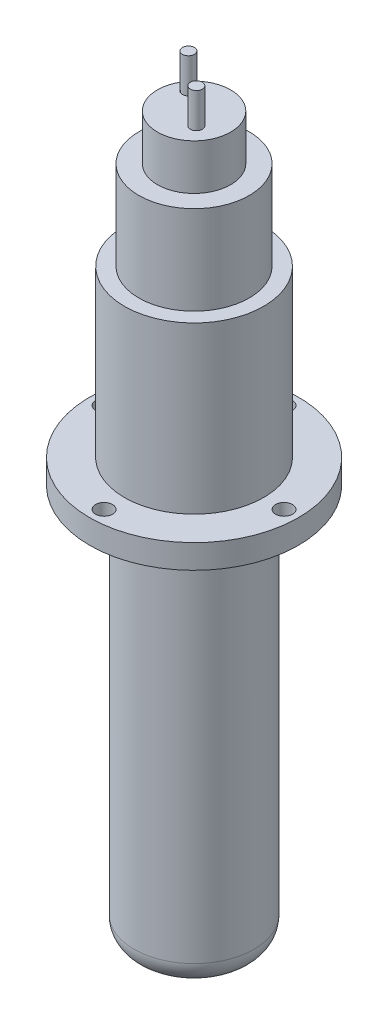
ISO-10303-21;
HEADER;
FILE_DESCRIPTION(('STEP AP214'),'2;1');
FILE_NAME('part.step','',(''),(''),'','','');
FILE_SCHEMA(('AUTOMOTIVE_DESIGN { 1 0 10303 214 1 1 1 1 }'));
ENDSEC;
DATA;
#1=APPLICATION_CONTEXT('core data for automotive mechanical design processes');
#2=APPLICATION_PROTOCOL_DEFINITION('international standard','automotive_design',2000,#1);
#3=PRODUCT_CONTEXT('',#1,'mechanical');
#4=PRODUCT('Part','Part','',(#3));
#5=PRODUCT_RELATED_PRODUCT_CATEGORY('part','',(#4));
#6=PRODUCT_DEFINITION_FORMATION('','',#4);
#7=PRODUCT_DEFINITION_CONTEXT('part definition',#1,'design');
#8=PRODUCT_DEFINITION('design','',#6,#7);
#9=PRODUCT_DEFINITION_SHAPE('','',#8);
#10=(LENGTH_UNIT() NAMED_UNIT(*) SI_UNIT(.MILLI.,.METRE.));
#11=(NAMED_UNIT(*) PLANE_ANGLE_UNIT() SI_UNIT($,.RADIAN.));
#12=(NAMED_UNIT(*) SI_UNIT($,.STERADIAN.) SOLID_ANGLE_UNIT());
#13=UNCERTAINTY_MEASURE_WITH_UNIT(LENGTH_MEASURE(1.E-05),#10,'distance_accuracy_value','');
#14=(GEOMETRIC_REPRESENTATION_CONTEXT(3) GLOBAL_UNCERTAINTY_ASSIGNED_CONTEXT((#13)) GLOBAL_UNIT_ASSIGNED_CONTEXT((#10,
#11,#12)) REPRESENTATION_CONTEXT('',''));
#15=CARTESIAN_POINT('',(0.,0.,0.));
#16=DIRECTION('',(0.,0.,1.));
#17=DIRECTION('',(1.,0.,0.));
#18=AXIS2_PLACEMENT_3D('',#15,#16,#17);
#19=CARTESIAN_POINT('',(0.,5.08,0.));
#20=DIRECTION('',(0.,-1.,0.));
#21=DIRECTION('',(0.,0.,-1.));
#22=AXIS2_PLACEMENT_3D('',#19,#20,#21);
#23=CYLINDRICAL_SURFACE('',#22,22.098);
#24=CARTESIAN_POINT('',(0.,5.08,0.));
#25=DIRECTION('',(0.,1.,0.));
#26=DIRECTION('',(0.,0.,1.));
#27=AXIS2_PLACEMENT_3D('',#24,#25,#26);
#28=CIRCLE('',#27,22.098);
#29=CARTESIAN_POINT('',(0.,5.08,22.098));
#30=VERTEX_POINT('',#29);
#31=EDGE_CURVE('E68',#30,#30,#28,.T.);
#32=ORIENTED_EDGE('',*,*,#31,.F.);
#33=EDGE_LOOP('',(#32));
#34=FACE_BOUND('',#33,.T.);
#35=CARTESIAN_POINT('',(0.,0.,0.));
#36=DIRECTION('',(0.,1.,0.));
#37=DIRECTION('',(0.,0.,1.));
#38=AXIS2_PLACEMENT_3D('',#35,#36,#37);
#39=CIRCLE('',#38,22.098);
#40=CARTESIAN_POINT('',(0.,0.,22.098));
#41=VERTEX_POINT('',#40);
#42=EDGE_CURVE('E65',#41,#41,#39,.T.);
#43=ORIENTED_EDGE('',*,*,#42,.T.);
#44=EDGE_LOOP('',(#43));
#45=FACE_BOUND('',#44,.T.);
#46=ADVANCED_FACE('F32',(#34,#45),#23,.T.);
#47=CARTESIAN_POINT('',(0.,5.08,0.));
#48=DIRECTION('',(0.,1.,0.));
#49=DIRECTION('',(0.,0.,1.));
#50=AXIS2_PLACEMENT_3D('',#47,#48,#49);
#51=PLANE('',#50);
#52=CARTESIAN_POINT('',(-19.05,5.08,0.));
#53=DIRECTION('',(0.,1.,0.));
#54=DIRECTION('',(1.,0.,0.));
#55=AXIS2_PLACEMENT_3D('',#52,#53,#54);
#56=CIRCLE('',#55,1.7907);
#57=CARTESIAN_POINT('',(-17.2593,5.08,0.));
#58=VERTEX_POINT('',#57);
#59=EDGE_CURVE('E60',#58,#58,#56,.T.);
#60=ORIENTED_EDGE('',*,*,#59,.F.);
#61=EDGE_LOOP('',(#60));
#62=FACE_BOUND('',#61,.T.);
#63=CARTESIAN_POINT('',(0.,5.08,19.05));
#64=DIRECTION('',(0.,1.,0.));
#65=DIRECTION('',(0.,0.,-1.));
#66=AXIS2_PLACEMENT_3D('',#63,#64,#65);
#67=CIRCLE('',#66,1.7907);
#68=CARTESIAN_POINT('',(0.,5.08,17.2593));
#69=VERTEX_POINT('',#68);
#70=EDGE_CURVE('E104',#69,#69,#67,.T.);
#71=ORIENTED_EDGE('',*,*,#70,.F.);
#72=EDGE_LOOP('',(#71));
#73=FACE_BOUND('',#72,.T.);
#74=CARTESIAN_POINT('',(19.05,5.08,-1.99538158514885E-13));
#75=DIRECTION('',(0.,1.,0.));
#76=DIRECTION('',(-1.,0.,0.));
#77=AXIS2_PLACEMENT_3D('',#74,#75,#76);
#78=CIRCLE('',#77,1.7907);
#79=CARTESIAN_POINT('',(17.2593,5.08,-1.80781571614486E-13));
#80=VERTEX_POINT('',#79);
#81=EDGE_CURVE('E101',#80,#80,#78,.T.);
#82=ORIENTED_EDGE('',*,*,#81,.F.);
#83=EDGE_LOOP('',(#82));
#84=FACE_BOUND('',#83,.T.);
#85=CARTESIAN_POINT('',(0.,5.08,-19.05));
#86=DIRECTION('',(0.,1.,0.));
#87=DIRECTION('',(0.,0.,1.));
#88=AXIS2_PLACEMENT_3D('',#85,#86,#87);
#89=CIRCLE('',#88,1.7907);
#90=CARTESIAN_POINT('',(0.,5.08,-17.2593));
#91=VERTEX_POINT('',#90);
#92=EDGE_CURVE('E53',#91,#91,#89,.T.);
#93=ORIENTED_EDGE('',*,*,#92,.F.);
#94=EDGE_LOOP('',(#93));
#95=FACE_BOUND('',#94,.T.);
#96=CARTESIAN_POINT('',(0.,5.08,0.));
#97=DIRECTION('',(0.,1.,0.));
#98=DIRECTION('',(0.,0.,1.));
#99=AXIS2_PLACEMENT_3D('',#96,#97,#98);
#100=CIRCLE('',#99,14.732);
#101=CARTESIAN_POINT('',(0.,5.08,14.732));
#102=VERTEX_POINT('',#101);
#103=EDGE_CURVE('E72',#102,#102,#100,.T.);
#104=ORIENTED_EDGE('',*,*,#103,.F.);
#105=EDGE_LOOP('',(#104));
#106=FACE_BOUND('',#105,.T.);
#107=ORIENTED_EDGE('',*,*,#31,.T.);
#108=EDGE_LOOP('',(#107));
#109=FACE_BOUND('',#108,.T.);
#110=ADVANCED_FACE('F113',(#62,#73,#84,#95,#106,#109),#51,.T.);
#111=CARTESIAN_POINT('',(0.,0.,0.));
#112=DIRECTION('',(0.,1.,0.));
#113=DIRECTION('',(0.,0.,1.));
#114=AXIS2_PLACEMENT_3D('',#111,#112,#113);
#115=PLANE('',#114);
#116=CARTESIAN_POINT('',(0.,0.,0.));
#117=DIRECTION('',(0.,1.,0.));
#118=DIRECTION('',(0.,0.,1.));
#119=AXIS2_PLACEMENT_3D('',#116,#117,#118);
#120=CIRCLE('',#119,12.7);
#121=CARTESIAN_POINT('',(0.,0.,12.7));
#122=VERTEX_POINT('',#121);
#123=EDGE_CURVE('E43',#122,#122,#120,.F.);
#124=ORIENTED_EDGE('',*,*,#123,.F.);
#125=EDGE_LOOP('',(#124));
#126=FACE_BOUND('',#125,.T.);
#127=CARTESIAN_POINT('',(-19.05,0.,0.));
#128=DIRECTION('',(0.,1.,0.));
#129=DIRECTION('',(0.,0.,1.));
#130=AXIS2_PLACEMENT_3D('',#127,#128,#129);
#131=CIRCLE('',#130,1.7907);
#132=CARTESIAN_POINT('',(-19.05,0.,1.79070000000007));
#133=VERTEX_POINT('',#132);
#134=EDGE_CURVE('E50',#133,#133,#131,.T.);
#135=ORIENTED_EDGE('',*,*,#134,.T.);
#136=EDGE_LOOP('',(#135));
#137=FACE_BOUND('',#136,.T.);
#138=CARTESIAN_POINT('',(0.,0.,19.05));
#139=DIRECTION('',(0.,1.,0.));
#140=DIRECTION('',(0.,0.,1.));
#141=AXIS2_PLACEMENT_3D('',#138,#139,#140);
#142=CIRCLE('',#141,1.7907);
#143=CARTESIAN_POINT('',(0.,0.,20.8407));
#144=VERTEX_POINT('',#143);
#145=EDGE_CURVE('E54',#144,#144,#142,.T.);
#146=ORIENTED_EDGE('',*,*,#145,.T.);
#147=EDGE_LOOP('',(#146));
#148=FACE_BOUND('',#147,.T.);
#149=CARTESIAN_POINT('',(19.05,0.,-1.99538158514885E-13));
#150=DIRECTION('',(0.,1.,0.));
#151=DIRECTION('',(0.,0.,1.));
#152=AXIS2_PLACEMENT_3D('',#149,#150,#151);
#153=CIRCLE('',#152,1.7907);
#154=CARTESIAN_POINT('',(19.05,0.,1.7906999999998));
#155=VERTEX_POINT('',#154);
#156=EDGE_CURVE('E57',#155,#155,#153,.T.);
#157=ORIENTED_EDGE('',*,*,#156,.T.);
#158=EDGE_LOOP('',(#157));
#159=FACE_BOUND('',#158,.T.);
#160=CARTESIAN_POINT('',(0.,0.,-19.05));
#161=DIRECTION('',(0.,1.,0.));
#162=DIRECTION('',(0.,0.,1.));
#163=AXIS2_PLACEMENT_3D('',#160,#161,#162);
#164=CIRCLE('',#163,1.7907);
#165=CARTESIAN_POINT('',(0.,0.,-17.2593));
#166=VERTEX_POINT('',#165);
#167=EDGE_CURVE('E61',#166,#166,#164,.T.);
#168=ORIENTED_EDGE('',*,*,#167,.T.);
#169=EDGE_LOOP('',(#168));
#170=FACE_BOUND('',#169,.T.);
#171=ORIENTED_EDGE('',*,*,#42,.F.);
#172=EDGE_LOOP('',(#171));
#173=FACE_BOUND('',#172,.T.);
#174=ADVANCED_FACE('F116',(#126,#137,#148,#159,#170,#173),#115,.F.);
#175=CARTESIAN_POINT('',(0.,40.132,0.));
#176=DIRECTION('',(0.,-1.,0.));
#177=DIRECTION('',(0.,0.,-1.));
#178=AXIS2_PLACEMENT_3D('',#175,#176,#177);
#179=CYLINDRICAL_SURFACE('',#178,14.732);
#180=CARTESIAN_POINT('',(0.,40.132,0.));
#181=DIRECTION('',(0.,1.,0.));
#182=DIRECTION('',(0.,0.,1.));
#183=AXIS2_PLACEMENT_3D('',#180,#181,#182);
#184=CIRCLE('',#183,14.732);
#185=CARTESIAN_POINT('',(0.,40.132,14.732));
#186=VERTEX_POINT('',#185);
#187=EDGE_CURVE('E69',#186,#186,#184,.T.);
#188=ORIENTED_EDGE('',*,*,#187,.F.);
#189=EDGE_LOOP('',(#188));
#190=FACE_BOUND('',#189,.T.);
#191=ORIENTED_EDGE('',*,*,#103,.T.);
#192=EDGE_LOOP('',(#191));
#193=FACE_BOUND('',#192,.T.);
#194=ADVANCED_FACE('F133',(#190,#193),#179,.T.);
#195=CARTESIAN_POINT('',(0.,40.132,0.));
#196=DIRECTION('',(0.,1.,0.));
#197=DIRECTION('',(0.,0.,1.));
#198=AXIS2_PLACEMENT_3D('',#195,#196,#197);
#199=PLANE('',#198);
#200=CARTESIAN_POINT('',(0.,40.132,0.));
#201=DIRECTION('',(0.,1.,0.));
#202=DIRECTION('',(0.,0.,1.));
#203=AXIS2_PLACEMENT_3D('',#200,#201,#202);
#204=CIRCLE('',#203,11.684);
#205=CARTESIAN_POINT('',(0.,40.132,11.684));
#206=VERTEX_POINT('',#205);
#207=EDGE_CURVE('E75',#206,#206,#204,.T.);
#208=ORIENTED_EDGE('',*,*,#207,.F.);
#209=EDGE_LOOP('',(#208));
#210=FACE_BOUND('',#209,.T.);
#211=ORIENTED_EDGE('',*,*,#187,.T.);
#212=EDGE_LOOP('',(#211));
#213=FACE_BOUND('',#212,.T.);
#214=ADVANCED_FACE('F139',(#210,#213),#199,.T.);
#215=CARTESIAN_POINT('',(0.,58.928,0.));
#216=DIRECTION('',(0.,-1.,0.));
#217=DIRECTION('',(0.,0.,-1.));
#218=AXIS2_PLACEMENT_3D('',#215,#216,#217);
#219=CYLINDRICAL_SURFACE('',#218,11.684);
#220=CARTESIAN_POINT('',(0.,58.928,0.));
#221=DIRECTION('',(0.,1.,0.));
#222=DIRECTION('',(0.,0.,1.));
#223=AXIS2_PLACEMENT_3D('',#220,#221,#222);
#224=CIRCLE('',#223,11.684);
#225=CARTESIAN_POINT('',(0.,58.928,11.684));
#226=VERTEX_POINT('',#225);
#227=EDGE_CURVE('E78',#226,#226,#224,.T.);
#228=ORIENTED_EDGE('',*,*,#227,.F.);
#229=EDGE_LOOP('',(#228));
#230=FACE_BOUND('',#229,.T.);
#231=ORIENTED_EDGE('',*,*,#207,.T.);
#232=EDGE_LOOP('',(#231));
#233=FACE_BOUND('',#232,.T.);
#234=ADVANCED_FACE('F147',(#230,#233),#219,.T.);
#235=CARTESIAN_POINT('',(0.,58.928,0.));
#236=DIRECTION('',(0.,1.,0.));
#237=DIRECTION('',(0.,0.,1.));
#238=AXIS2_PLACEMENT_3D('',#235,#236,#237);
#239=PLANE('',#238);
#240=CARTESIAN_POINT('',(0.,58.928,0.));
#241=DIRECTION('',(0.,1.,0.));
#242=DIRECTION('',(0.,0.,1.));
#243=AXIS2_PLACEMENT_3D('',#240,#241,#242);
#244=CIRCLE('',#243,7.747);
#245=CARTESIAN_POINT('',(0.,58.928,7.747));
#246=VERTEX_POINT('',#245);
#247=EDGE_CURVE('E47',#246,#246,#244,.T.);
#248=ORIENTED_EDGE('',*,*,#247,.F.);
#249=EDGE_LOOP('',(#248));
#250=FACE_BOUND('',#249,.T.);
#251=ORIENTED_EDGE('',*,*,#227,.T.);
#252=EDGE_LOOP('',(#251));
#253=FACE_BOUND('',#252,.T.);
#254=ADVANCED_FACE('F151',(#250,#253),#239,.T.);
#255=CARTESIAN_POINT('',(0.,68.58,0.));
#256=DIRECTION('',(0.,-1.,0.));
#257=DIRECTION('',(0.,0.,-1.));
#258=AXIS2_PLACEMENT_3D('',#255,#256,#257);
#259=CYLINDRICAL_SURFACE('',#258,7.747);
#260=CARTESIAN_POINT('',(0.,68.58,0.));
#261=DIRECTION('',(0.,1.,0.));
#262=DIRECTION('',(0.,0.,1.));
#263=AXIS2_PLACEMENT_3D('',#260,#261,#262);
#264=CIRCLE('',#263,7.747);
#265=CARTESIAN_POINT('',(0.,68.58,7.747));
#266=VERTEX_POINT('',#265);
#267=EDGE_CURVE('E83',#266,#266,#264,.T.);
#268=ORIENTED_EDGE('',*,*,#267,.F.);
#269=EDGE_LOOP('',(#268));
#270=FACE_BOUND('',#269,.T.);
#271=ORIENTED_EDGE('',*,*,#247,.T.);
#272=EDGE_LOOP('',(#271));
#273=FACE_BOUND('',#272,.T.);
#274=ADVANCED_FACE('F155',(#270,#273),#259,.T.);
#275=CARTESIAN_POINT('',(0.,68.58,0.));
#276=DIRECTION('',(0.,1.,0.));
#277=DIRECTION('',(0.,0.,1.));
#278=AXIS2_PLACEMENT_3D('',#275,#276,#277);
#279=PLANE('',#278);
#280=CARTESIAN_POINT('',(2.97002677292824,68.58,2.48175750236612));
#281=DIRECTION('',(0.,1.,0.));
#282=DIRECTION('',(0.,0.,1.));
#283=AXIS2_PLACEMENT_3D('',#280,#281,#282);
#284=CIRCLE('',#283,1.27);
#285=CARTESIAN_POINT('',(2.97002677292824,68.58,3.75175750236612));
#286=VERTEX_POINT('',#285);
#287=EDGE_CURVE('E64',#286,#286,#284,.T.);
#288=ORIENTED_EDGE('',*,*,#287,.F.);
#289=EDGE_LOOP('',(#288));
#290=FACE_BOUND('',#289,.T.);
#291=CARTESIAN_POINT('',(-4.24340631789732,68.58,-3.04439882199858));
#292=DIRECTION('',(0.,1.,0.));
#293=DIRECTION('',(0.,0.,1.));
#294=AXIS2_PLACEMENT_3D('',#291,#292,#293);
#295=CIRCLE('',#294,1.27);
#296=CARTESIAN_POINT('',(-4.24340631789732,68.58,-1.77439882199858));
#297=VERTEX_POINT('',#296);
#298=EDGE_CURVE('E89',#297,#297,#295,.T.);
#299=ORIENTED_EDGE('',*,*,#298,.F.);
#300=EDGE_LOOP('',(#299));
#301=FACE_BOUND('',#300,.T.);
#302=ORIENTED_EDGE('',*,*,#267,.T.);
#303=EDGE_LOOP('',(#302));
#304=FACE_BOUND('',#303,.T.);
#305=ADVANCED_FACE('F159',(#290,#301,#304),#279,.T.);
#306=CARTESIAN_POINT('',(-4.24340631789732,75.946,-3.04439882199858));
#307=DIRECTION('',(0.,-1.,0.));
#308=DIRECTION('',(0.,0.,-1.));
#309=AXIS2_PLACEMENT_3D('',#306,#307,#308);
#310=CYLINDRICAL_SURFACE('',#309,1.27);
#311=CARTESIAN_POINT('',(-4.24340631789732,75.946,-3.04439882199858));
#312=DIRECTION('',(0.,1.,0.));
#313=DIRECTION('',(0.,0.,1.));
#314=AXIS2_PLACEMENT_3D('',#311,#312,#313);
#315=CIRCLE('',#314,1.27);
#316=CARTESIAN_POINT('',(-4.24340631789732,75.946,-1.77439882199858));
#317=VERTEX_POINT('',#316);
#318=EDGE_CURVE('E88',#317,#317,#315,.T.);
#319=ORIENTED_EDGE('',*,*,#318,.F.);
#320=EDGE_LOOP('',(#319));
#321=FACE_BOUND('',#320,.T.);
#322=ORIENTED_EDGE('',*,*,#298,.T.);
#323=EDGE_LOOP('',(#322));
#324=FACE_BOUND('',#323,.T.);
#325=ADVANCED_FACE('F163',(#321,#324),#310,.T.);
#326=CARTESIAN_POINT('',(-4.24340631789732,75.946,-3.04439882199858));
#327=DIRECTION('',(0.,1.,0.));
#328=DIRECTION('',(0.,0.,1.));
#329=AXIS2_PLACEMENT_3D('',#326,#327,#328);
#330=PLANE('',#329);
#331=ORIENTED_EDGE('',*,*,#318,.T.);
#332=EDGE_LOOP('',(#331));
#333=FACE_BOUND('',#332,.T.);
#334=ADVANCED_FACE('F167',(#333),#330,.T.);
#335=CARTESIAN_POINT('',(2.97002677292824,75.946,2.48175750236612));
#336=DIRECTION('',(0.,-1.,0.));
#337=DIRECTION('',(0.,0.,-1.));
#338=AXIS2_PLACEMENT_3D('',#335,#336,#337);
#339=CYLINDRICAL_SURFACE('',#338,1.27);
#340=CARTESIAN_POINT('',(2.97002677292824,75.946,2.48175750236612));
#341=DIRECTION('',(0.,1.,0.));
#342=DIRECTION('',(0.,0.,1.));
#343=AXIS2_PLACEMENT_3D('',#340,#341,#342);
#344=CIRCLE('',#343,1.27);
#345=CARTESIAN_POINT('',(2.97002677292824,75.946,3.75175750236612));
#346=VERTEX_POINT('',#345);
#347=EDGE_CURVE('E92',#346,#346,#344,.T.);
#348=ORIENTED_EDGE('',*,*,#347,.F.);
#349=EDGE_LOOP('',(#348));
#350=FACE_BOUND('',#349,.T.);
#351=ORIENTED_EDGE('',*,*,#287,.T.);
#352=EDGE_LOOP('',(#351));
#353=FACE_BOUND('',#352,.T.);
#354=ADVANCED_FACE('F171',(#350,#353),#339,.T.);
#355=CARTESIAN_POINT('',(2.97002677292824,75.946,2.48175750236612));
#356=DIRECTION('',(0.,1.,0.));
#357=DIRECTION('',(0.,0.,1.));
#358=AXIS2_PLACEMENT_3D('',#355,#356,#357);
#359=PLANE('',#358);
#360=ORIENTED_EDGE('',*,*,#347,.T.);
#361=EDGE_LOOP('',(#360));
#362=FACE_BOUND('',#361,.T.);
#363=ADVANCED_FACE('F175',(#362),#359,.T.);
#364=CARTESIAN_POINT('',(0.,-2.286,-19.05));
#365=DIRECTION('',(0.,1.,0.));
#366=DIRECTION('',(0.,0.,1.));
#367=AXIS2_PLACEMENT_3D('',#364,#365,#366);
#368=CYLINDRICAL_SURFACE('',#367,1.7907);
#369=ORIENTED_EDGE('',*,*,#92,.T.);
#370=EDGE_LOOP('',(#369));
#371=FACE_BOUND('',#370,.T.);
#372=ORIENTED_EDGE('',*,*,#167,.F.);
#373=EDGE_LOOP('',(#372));
#374=FACE_BOUND('',#373,.T.);
#375=ADVANCED_FACE('F179',(#371,#374),#368,.F.);
#376=CARTESIAN_POINT('',(19.05,-2.286,-1.99538158514885E-13));
#377=DIRECTION('',(0.,1.,0.));
#378=DIRECTION('',(0.,0.,1.));
#379=AXIS2_PLACEMENT_3D('',#376,#377,#378);
#380=CYLINDRICAL_SURFACE('',#379,1.7907);
#381=ORIENTED_EDGE('',*,*,#81,.T.);
#382=EDGE_LOOP('',(#381));
#383=FACE_BOUND('',#382,.T.);
#384=ORIENTED_EDGE('',*,*,#156,.F.);
#385=EDGE_LOOP('',(#384));
#386=FACE_BOUND('',#385,.T.);
#387=ADVANCED_FACE('F183',(#383,#386),#380,.F.);
#388=CARTESIAN_POINT('',(0.,-2.286,19.05));
#389=DIRECTION('',(0.,1.,0.));
#390=DIRECTION('',(0.,0.,1.));
#391=AXIS2_PLACEMENT_3D('',#388,#389,#390);
#392=CYLINDRICAL_SURFACE('',#391,1.7907);
#393=ORIENTED_EDGE('',*,*,#70,.T.);
#394=EDGE_LOOP('',(#393));
#395=FACE_BOUND('',#394,.T.);
#396=ORIENTED_EDGE('',*,*,#145,.F.);
#397=EDGE_LOOP('',(#396));
#398=FACE_BOUND('',#397,.T.);
#399=ADVANCED_FACE('F187',(#395,#398),#392,.F.);
#400=CARTESIAN_POINT('',(-19.05,-2.286,0.));
#401=DIRECTION('',(0.,1.,0.));
#402=DIRECTION('',(0.,0.,1.));
#403=AXIS2_PLACEMENT_3D('',#400,#401,#402);
#404=CYLINDRICAL_SURFACE('',#403,1.7907);
#405=ORIENTED_EDGE('',*,*,#59,.T.);
#406=EDGE_LOOP('',(#405));
#407=FACE_BOUND('',#406,.T.);
#408=ORIENTED_EDGE('',*,*,#134,.F.);
#409=EDGE_LOOP('',(#408));
#410=FACE_BOUND('',#409,.T.);
#411=ADVANCED_FACE('F110',(#407,#410),#404,.F.);
#412=CARTESIAN_POINT('',(0.,-83.82,0.));
#413=DIRECTION('',(0.,1.,0.));
#414=DIRECTION('',(0.,0.,1.));
#415=AXIS2_PLACEMENT_3D('',#412,#413,#414);
#416=CYLINDRICAL_SURFACE('',#415,12.7);
#417=CARTESIAN_POINT('',(0.,-78.74,0.));
#418=DIRECTION('',(0.,-1.,0.));
#419=DIRECTION('',(0.,0.,-1.));
#420=AXIS2_PLACEMENT_3D('',#417,#418,#419);
#421=CIRCLE('',#420,12.7);
#422=CARTESIAN_POINT('',(0.,-78.74,-12.7));
#423=VERTEX_POINT('',#422);
#424=EDGE_CURVE('E10',#423,#423,#421,.F.);
#425=ORIENTED_EDGE('',*,*,#424,.T.);
#426=EDGE_LOOP('',(#425));
#427=FACE_BOUND('',#426,.T.);
#428=ORIENTED_EDGE('',*,*,#123,.T.);
#429=EDGE_LOOP('',(#428));
#430=FACE_BOUND('',#429,.T.);
#431=ADVANCED_FACE('F194',(#427,#430),#416,.T.);
#432=CARTESIAN_POINT('',(0.,-83.82,0.));
#433=DIRECTION('',(0.,-1.,0.));
#434=DIRECTION('',(0.,0.,-1.));
#435=AXIS2_PLACEMENT_3D('',#432,#433,#434);
#436=PLANE('',#435);
#437=CARTESIAN_POINT('',(0.,-83.82,0.));
#438=DIRECTION('',(0.,-1.,0.));
#439=DIRECTION('',(0.,0.,-1.));
#440=AXIS2_PLACEMENT_3D('',#437,#438,#439);
#441=CIRCLE('',#440,7.62);
#442=CARTESIAN_POINT('',(0.,-83.82,-7.62));
#443=VERTEX_POINT('',#442);
#444=EDGE_CURVE('E39',#443,#443,#441,.T.);
#445=ORIENTED_EDGE('',*,*,#444,.T.);
#446=EDGE_LOOP('',(#445));
#447=FACE_BOUND('',#446,.T.);
#448=ADVANCED_FACE('F197',(#447),#436,.T.);
#449=CARTESIAN_POINT('',(0.,-78.74,0.));
#450=DIRECTION('',(0.,-1.,0.));
#451=DIRECTION('',(0.,0.,-1.));
#452=AXIS2_PLACEMENT_3D('',#449,#450,#451);
#453=TOROIDAL_SURFACE('',#452,7.62,5.08);
#454=ORIENTED_EDGE('',*,*,#424,.F.);
#455=EDGE_LOOP('',(#454));
#456=FACE_BOUND('',#455,.T.);
#457=ORIENTED_EDGE('',*,*,#444,.F.);
#458=EDGE_LOOP('',(#457));
#459=FACE_BOUND('',#458,.T.);
#460=ADVANCED_FACE('F34',(#456,#459),#453,.T.);
#461=CLOSED_SHELL('',(#46,#110,#174,#194,#214,#234,#254,#274,#305,#325,#334,#354,#363,#375,#387,
#399,#411,#431,#448,#460));
#462=MANIFOLD_SOLID_BREP('B2',#461);
#463=ADVANCED_BREP_SHAPE_REPRESENTATION('',(#18,#462),#14);
#464=SHAPE_DEFINITION_REPRESENTATION(#9,#463);
ENDSEC;
END-ISO-10303-21;
